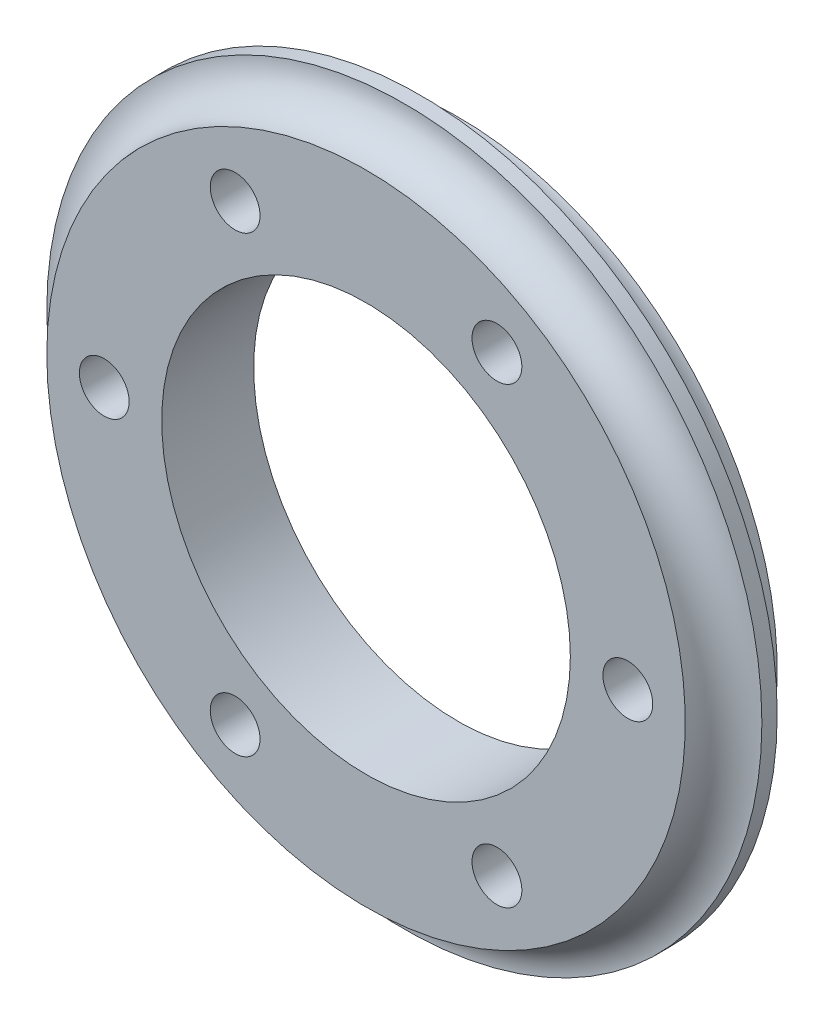
ISO-10303-21;
HEADER;
FILE_DESCRIPTION(('STEP AP214'),'2;1');
FILE_NAME('part.step','',(''),(''),'','','');
FILE_SCHEMA(('AUTOMOTIVE_DESIGN { 1 0 10303 214 1 1 1 1 }'));
ENDSEC;
DATA;
#1=APPLICATION_CONTEXT('core data for automotive mechanical design processes');
#2=APPLICATION_PROTOCOL_DEFINITION('international standard','automotive_design',2000,#1);
#3=PRODUCT_CONTEXT('',#1,'mechanical');
#4=PRODUCT('Part','Part','',(#3));
#5=PRODUCT_RELATED_PRODUCT_CATEGORY('part','',(#4));
#6=PRODUCT_DEFINITION_FORMATION('','',#4);
#7=PRODUCT_DEFINITION_CONTEXT('part definition',#1,'design');
#8=PRODUCT_DEFINITION('design','',#6,#7);
#9=PRODUCT_DEFINITION_SHAPE('','',#8);
#10=(LENGTH_UNIT() NAMED_UNIT(*) SI_UNIT(.MILLI.,.METRE.));
#11=(NAMED_UNIT(*) PLANE_ANGLE_UNIT() SI_UNIT($,.RADIAN.));
#12=(NAMED_UNIT(*) SI_UNIT($,.STERADIAN.) SOLID_ANGLE_UNIT());
#13=UNCERTAINTY_MEASURE_WITH_UNIT(LENGTH_MEASURE(1.E-05),#10,'distance_accuracy_value','');
#14=(GEOMETRIC_REPRESENTATION_CONTEXT(3) GLOBAL_UNCERTAINTY_ASSIGNED_CONTEXT((#13)) GLOBAL_UNIT_ASSIGNED_CONTEXT((#10,
#11,#12)) REPRESENTATION_CONTEXT('',''));
#15=CARTESIAN_POINT('',(0.,0.,0.));
#16=DIRECTION('',(0.,0.,1.));
#17=DIRECTION('',(1.,0.,0.));
#18=AXIS2_PLACEMENT_3D('',#15,#16,#17);
#19=CARTESIAN_POINT('',(0.,0.,6.));
#20=DIRECTION('',(0.,0.,-1.));
#21=DIRECTION('',(-1.,0.,0.));
#22=AXIS2_PLACEMENT_3D('',#19,#20,#21);
#23=CYLINDRICAL_SURFACE('',#22,23.335);
#24=CARTESIAN_POINT('',(0.,0.,2.5));
#25=DIRECTION('',(0.,0.,-1.));
#26=DIRECTION('',(-1.,0.,0.));
#27=AXIS2_PLACEMENT_3D('',#24,#25,#26);
#28=CIRCLE('',#27,23.335);
#29=CARTESIAN_POINT('',(-23.335,0.,2.5));
#30=VERTEX_POINT('',#29);
#31=EDGE_CURVE('E47',#30,#30,#28,.T.);
#32=ORIENTED_EDGE('',*,*,#31,.F.);
#33=EDGE_LOOP('',(#32));
#34=FACE_BOUND('',#33,.T.);
#35=CARTESIAN_POINT('',(0.,0.,3.5));
#36=DIRECTION('',(0.,0.,1.));
#37=DIRECTION('',(1.,0.,0.));
#38=AXIS2_PLACEMENT_3D('',#35,#36,#37);
#39=CIRCLE('',#38,23.335);
#40=CARTESIAN_POINT('',(23.335,0.,3.5));
#41=VERTEX_POINT('',#40);
#42=EDGE_CURVE('E49',#41,#41,#39,.T.);
#43=ORIENTED_EDGE('',*,*,#42,.F.);
#44=EDGE_LOOP('',(#43));
#45=FACE_BOUND('',#44,.T.);
#46=ADVANCED_FACE('F31',(#34,#45),#23,.T.);
#47=CARTESIAN_POINT('',(0.,0.,6.));
#48=DIRECTION('',(0.,0.,1.));
#49=DIRECTION('',(1.,0.,0.));
#50=AXIS2_PLACEMENT_3D('',#47,#48,#49);
#51=PLANE('',#50);
#52=CARTESIAN_POINT('',(-17.085,0.,6.));
#53=DIRECTION('',(0.,0.,-1.));
#54=DIRECTION('',(-1.,0.,0.));
#55=AXIS2_PLACEMENT_3D('',#52,#53,#54);
#56=CIRCLE('',#55,1.625);
#57=CARTESIAN_POINT('',(-18.71,0.,6.));
#58=VERTEX_POINT('',#57);
#59=EDGE_CURVE('E86',#58,#58,#56,.T.);
#60=ORIENTED_EDGE('',*,*,#59,.T.);
#61=EDGE_LOOP('',(#60));
#62=FACE_BOUND('',#61,.T.);
#63=CARTESIAN_POINT('',(-8.5425,-14.7960440236571,6.));
#64=DIRECTION('',(0.,0.,-1.));
#65=DIRECTION('',(-1.,0.,0.));
#66=AXIS2_PLACEMENT_3D('',#63,#64,#65);
#67=CIRCLE('',#66,1.625);
#68=CARTESIAN_POINT('',(-10.1675,-14.7960440236571,6.));
#69=VERTEX_POINT('',#68);
#70=EDGE_CURVE('E80',#69,#69,#67,.T.);
#71=ORIENTED_EDGE('',*,*,#70,.T.);
#72=EDGE_LOOP('',(#71));
#73=FACE_BOUND('',#72,.T.);
#74=CARTESIAN_POINT('',(8.54250000000001,-14.7960440236571,6.));
#75=DIRECTION('',(0.,0.,-1.));
#76=DIRECTION('',(-1.,0.,0.));
#77=AXIS2_PLACEMENT_3D('',#74,#75,#76);
#78=CIRCLE('',#77,1.625);
#79=CARTESIAN_POINT('',(6.9175,-14.7960440236571,6.));
#80=VERTEX_POINT('',#79);
#81=EDGE_CURVE('E74',#80,#80,#78,.T.);
#82=ORIENTED_EDGE('',*,*,#81,.T.);
#83=EDGE_LOOP('',(#82));
#84=FACE_BOUND('',#83,.T.);
#85=CARTESIAN_POINT('',(17.085,0.,6.));
#86=DIRECTION('',(0.,0.,-1.));
#87=DIRECTION('',(-1.,0.,0.));
#88=AXIS2_PLACEMENT_3D('',#85,#86,#87);
#89=CIRCLE('',#88,1.625);
#90=CARTESIAN_POINT('',(15.46,0.,6.));
#91=VERTEX_POINT('',#90);
#92=EDGE_CURVE('E68',#91,#91,#89,.T.);
#93=ORIENTED_EDGE('',*,*,#92,.T.);
#94=EDGE_LOOP('',(#93));
#95=FACE_BOUND('',#94,.T.);
#96=CARTESIAN_POINT('',(8.5425,14.7960440236571,6.));
#97=DIRECTION('',(0.,0.,-1.));
#98=DIRECTION('',(-1.,0.,0.));
#99=AXIS2_PLACEMENT_3D('',#96,#97,#98);
#100=CIRCLE('',#99,1.625);
#101=CARTESIAN_POINT('',(6.9175,14.7960440236571,6.));
#102=VERTEX_POINT('',#101);
#103=EDGE_CURVE('E62',#102,#102,#100,.T.);
#104=ORIENTED_EDGE('',*,*,#103,.T.);
#105=EDGE_LOOP('',(#104));
#106=FACE_BOUND('',#105,.T.);
#107=CARTESIAN_POINT('',(-8.54250000000001,14.7960440236571,6.));
#108=DIRECTION('',(0.,0.,-1.));
#109=DIRECTION('',(-1.,0.,0.));
#110=AXIS2_PLACEMENT_3D('',#107,#108,#109);
#111=CIRCLE('',#110,1.625);
#112=CARTESIAN_POINT('',(-10.1675,14.7960440236571,6.));
#113=VERTEX_POINT('',#112);
#114=EDGE_CURVE('E57',#113,#113,#111,.T.);
#115=ORIENTED_EDGE('',*,*,#114,.T.);
#116=EDGE_LOOP('',(#115));
#117=FACE_BOUND('',#116,.T.);
#118=CARTESIAN_POINT('',(0.,0.,6.));
#119=DIRECTION('',(0.,0.,1.));
#120=DIRECTION('',(1.,0.,0.));
#121=AXIS2_PLACEMENT_3D('',#118,#119,#120);
#122=CIRCLE('',#121,13.335);
#123=CARTESIAN_POINT('',(13.335,0.,6.));
#124=VERTEX_POINT('',#123);
#125=EDGE_CURVE('E10',#124,#124,#122,.T.);
#126=ORIENTED_EDGE('',*,*,#125,.F.);
#127=EDGE_LOOP('',(#126));
#128=FACE_BOUND('',#127,.T.);
#129=CARTESIAN_POINT('',(0.,0.,6.));
#130=DIRECTION('',(0.,0.,-1.));
#131=DIRECTION('',(-1.,0.,0.));
#132=AXIS2_PLACEMENT_3D('',#129,#130,#131);
#133=CIRCLE('',#132,20.835);
#134=CARTESIAN_POINT('',(-20.835,0.,6.));
#135=VERTEX_POINT('',#134);
#136=EDGE_CURVE('E34',#135,#135,#133,.F.);
#137=ORIENTED_EDGE('',*,*,#136,.T.);
#138=EDGE_LOOP('',(#137));
#139=FACE_BOUND('',#138,.T.);
#140=ADVANCED_FACE('F95',(#62,#73,#84,#95,#106,#117,#128,#139),#51,.T.);
#141=CARTESIAN_POINT('',(0.,0.,0.));
#142=DIRECTION('',(0.,0.,1.));
#143=DIRECTION('',(1.,0.,0.));
#144=AXIS2_PLACEMENT_3D('',#141,#142,#143);
#145=PLANE('',#144);
#146=CARTESIAN_POINT('',(-17.085,0.,0.));
#147=DIRECTION('',(0.,0.,-1.));
#148=DIRECTION('',(-1.,0.,0.));
#149=AXIS2_PLACEMENT_3D('',#146,#147,#148);
#150=CIRCLE('',#149,1.625);
#151=CARTESIAN_POINT('',(-18.71,0.,0.));
#152=VERTEX_POINT('',#151);
#153=EDGE_CURVE('E89',#152,#152,#150,.T.);
#154=ORIENTED_EDGE('',*,*,#153,.F.);
#155=EDGE_LOOP('',(#154));
#156=FACE_BOUND('',#155,.T.);
#157=CARTESIAN_POINT('',(-8.5425,-14.7960440236571,0.));
#158=DIRECTION('',(0.,0.,-1.));
#159=DIRECTION('',(-1.,0.,0.));
#160=AXIS2_PLACEMENT_3D('',#157,#158,#159);
#161=CIRCLE('',#160,1.625);
#162=CARTESIAN_POINT('',(-10.1675,-14.7960440236571,0.));
#163=VERTEX_POINT('',#162);
#164=EDGE_CURVE('E83',#163,#163,#161,.T.);
#165=ORIENTED_EDGE('',*,*,#164,.F.);
#166=EDGE_LOOP('',(#165));
#167=FACE_BOUND('',#166,.T.);
#168=CARTESIAN_POINT('',(8.54250000000001,-14.7960440236571,0.));
#169=DIRECTION('',(0.,0.,-1.));
#170=DIRECTION('',(-1.,0.,0.));
#171=AXIS2_PLACEMENT_3D('',#168,#169,#170);
#172=CIRCLE('',#171,1.625);
#173=CARTESIAN_POINT('',(6.9175,-14.7960440236571,0.));
#174=VERTEX_POINT('',#173);
#175=EDGE_CURVE('E77',#174,#174,#172,.T.);
#176=ORIENTED_EDGE('',*,*,#175,.F.);
#177=EDGE_LOOP('',(#176));
#178=FACE_BOUND('',#177,.T.);
#179=CARTESIAN_POINT('',(17.085,0.,0.));
#180=DIRECTION('',(0.,0.,-1.));
#181=DIRECTION('',(-1.,0.,0.));
#182=AXIS2_PLACEMENT_3D('',#179,#180,#181);
#183=CIRCLE('',#182,1.625);
#184=CARTESIAN_POINT('',(15.46,0.,0.));
#185=VERTEX_POINT('',#184);
#186=EDGE_CURVE('E71',#185,#185,#183,.T.);
#187=ORIENTED_EDGE('',*,*,#186,.F.);
#188=EDGE_LOOP('',(#187));
#189=FACE_BOUND('',#188,.T.);
#190=CARTESIAN_POINT('',(8.5425,14.7960440236571,0.));
#191=DIRECTION('',(0.,0.,-1.));
#192=DIRECTION('',(-1.,0.,0.));
#193=AXIS2_PLACEMENT_3D('',#190,#191,#192);
#194=CIRCLE('',#193,1.625);
#195=CARTESIAN_POINT('',(6.9175,14.7960440236571,0.));
#196=VERTEX_POINT('',#195);
#197=EDGE_CURVE('E65',#196,#196,#194,.T.);
#198=ORIENTED_EDGE('',*,*,#197,.F.);
#199=EDGE_LOOP('',(#198));
#200=FACE_BOUND('',#199,.T.);
#201=CARTESIAN_POINT('',(-8.54250000000001,14.7960440236571,0.));
#202=DIRECTION('',(0.,0.,-1.));
#203=DIRECTION('',(-1.,0.,0.));
#204=AXIS2_PLACEMENT_3D('',#201,#202,#203);
#205=CIRCLE('',#204,1.625);
#206=CARTESIAN_POINT('',(-10.1675,14.7960440236571,0.));
#207=VERTEX_POINT('',#206);
#208=EDGE_CURVE('E59',#207,#207,#205,.T.);
#209=ORIENTED_EDGE('',*,*,#208,.F.);
#210=EDGE_LOOP('',(#209));
#211=FACE_BOUND('',#210,.T.);
#212=CARTESIAN_POINT('',(0.,0.,0.));
#213=DIRECTION('',(0.,0.,1.));
#214=DIRECTION('',(1.,0.,0.));
#215=AXIS2_PLACEMENT_3D('',#212,#213,#214);
#216=CIRCLE('',#215,13.335);
#217=CARTESIAN_POINT('',(13.335,0.,0.));
#218=VERTEX_POINT('',#217);
#219=EDGE_CURVE('E38',#218,#218,#216,.T.);
#220=ORIENTED_EDGE('',*,*,#219,.T.);
#221=EDGE_LOOP('',(#220));
#222=FACE_BOUND('',#221,.T.);
#223=CARTESIAN_POINT('',(0.,0.,0.));
#224=DIRECTION('',(0.,0.,-1.));
#225=DIRECTION('',(-1.,0.,0.));
#226=AXIS2_PLACEMENT_3D('',#223,#224,#225);
#227=CIRCLE('',#226,20.835);
#228=CARTESIAN_POINT('',(-20.835,0.,0.));
#229=VERTEX_POINT('',#228);
#230=EDGE_CURVE('E43',#229,#229,#227,.F.);
#231=ORIENTED_EDGE('',*,*,#230,.F.);
#232=EDGE_LOOP('',(#231));
#233=FACE_BOUND('',#232,.T.);
#234=ADVANCED_FACE('F105',(#156,#167,#178,#189,#200,#211,#222,#233),#145,.F.);
#235=CARTESIAN_POINT('',(0.,0.,6.));
#236=DIRECTION('',(0.,0.,-1.));
#237=DIRECTION('',(-1.,0.,0.));
#238=AXIS2_PLACEMENT_3D('',#235,#236,#237);
#239=CYLINDRICAL_SURFACE('',#238,13.335);
#240=ORIENTED_EDGE('',*,*,#125,.T.);
#241=EDGE_LOOP('',(#240));
#242=FACE_BOUND('',#241,.T.);
#243=ORIENTED_EDGE('',*,*,#219,.F.);
#244=EDGE_LOOP('',(#243));
#245=FACE_BOUND('',#244,.T.);
#246=ADVANCED_FACE('F108',(#242,#245),#239,.F.);
#247=CARTESIAN_POINT('',(0.,0.,0.));
#248=DIRECTION('',(0.,0.,1.));
#249=DIRECTION('',(1.,0.,0.));
#250=AXIS2_PLACEMENT_3D('',#247,#248,#249);
#251=TOROIDAL_SURFACE('',#250,23.335,2.5);
#252=ORIENTED_EDGE('',*,*,#31,.T.);
#253=EDGE_LOOP('',(#252));
#254=FACE_BOUND('',#253,.T.);
#255=ORIENTED_EDGE('',*,*,#230,.T.);
#256=EDGE_LOOP('',(#255));
#257=FACE_BOUND('',#256,.T.);
#258=ADVANCED_FACE('F123',(#254,#257),#251,.F.);
#259=CARTESIAN_POINT('',(0.,0.,6.));
#260=DIRECTION('',(0.,0.,1.));
#261=DIRECTION('',(1.,0.,0.));
#262=AXIS2_PLACEMENT_3D('',#259,#260,#261);
#263=TOROIDAL_SURFACE('',#262,23.335,2.5);
#264=ORIENTED_EDGE('',*,*,#136,.F.);
#265=EDGE_LOOP('',(#264));
#266=FACE_BOUND('',#265,.T.);
#267=ORIENTED_EDGE('',*,*,#42,.T.);
#268=EDGE_LOOP('',(#267));
#269=FACE_BOUND('',#268,.T.);
#270=ADVANCED_FACE('F125',(#266,#269),#263,.F.);
#271=CARTESIAN_POINT('',(-8.54250000000001,14.7960440236571,6.));
#272=DIRECTION('',(0.,0.,-1.));
#273=DIRECTION('',(-1.,0.,0.));
#274=AXIS2_PLACEMENT_3D('',#271,#272,#273);
#275=CYLINDRICAL_SURFACE('',#274,1.625);
#276=ORIENTED_EDGE('',*,*,#114,.F.);
#277=EDGE_LOOP('',(#276));
#278=FACE_BOUND('',#277,.T.);
#279=ORIENTED_EDGE('',*,*,#208,.T.);
#280=EDGE_LOOP('',(#279));
#281=FACE_BOUND('',#280,.T.);
#282=ADVANCED_FACE('F131',(#278,#281),#275,.F.);
#283=CARTESIAN_POINT('',(8.5425,14.7960440236571,6.));
#284=DIRECTION('',(0.,0.,-1.));
#285=DIRECTION('',(-1.,0.,0.));
#286=AXIS2_PLACEMENT_3D('',#283,#284,#285);
#287=CYLINDRICAL_SURFACE('',#286,1.625);
#288=ORIENTED_EDGE('',*,*,#103,.F.);
#289=EDGE_LOOP('',(#288));
#290=FACE_BOUND('',#289,.T.);
#291=ORIENTED_EDGE('',*,*,#197,.T.);
#292=EDGE_LOOP('',(#291));
#293=FACE_BOUND('',#292,.T.);
#294=ADVANCED_FACE('F175',(#290,#293),#287,.F.);
#295=CARTESIAN_POINT('',(17.085,0.,6.));
#296=DIRECTION('',(0.,0.,-1.));
#297=DIRECTION('',(-1.,0.,0.));
#298=AXIS2_PLACEMENT_3D('',#295,#296,#297);
#299=CYLINDRICAL_SURFACE('',#298,1.625);
#300=ORIENTED_EDGE('',*,*,#92,.F.);
#301=EDGE_LOOP('',(#300));
#302=FACE_BOUND('',#301,.T.);
#303=ORIENTED_EDGE('',*,*,#186,.T.);
#304=EDGE_LOOP('',(#303));
#305=FACE_BOUND('',#304,.T.);
#306=ADVANCED_FACE('F182',(#302,#305),#299,.F.);
#307=CARTESIAN_POINT('',(8.54250000000001,-14.7960440236571,6.));
#308=DIRECTION('',(0.,0.,-1.));
#309=DIRECTION('',(-1.,0.,0.));
#310=AXIS2_PLACEMENT_3D('',#307,#308,#309);
#311=CYLINDRICAL_SURFACE('',#310,1.625);
#312=ORIENTED_EDGE('',*,*,#81,.F.);
#313=EDGE_LOOP('',(#312));
#314=FACE_BOUND('',#313,.T.);
#315=ORIENTED_EDGE('',*,*,#175,.T.);
#316=EDGE_LOOP('',(#315));
#317=FACE_BOUND('',#316,.T.);
#318=ADVANCED_FACE('F190',(#314,#317),#311,.F.);
#319=CARTESIAN_POINT('',(-8.5425,-14.7960440236571,6.));
#320=DIRECTION('',(0.,0.,-1.));
#321=DIRECTION('',(-1.,0.,0.));
#322=AXIS2_PLACEMENT_3D('',#319,#320,#321);
#323=CYLINDRICAL_SURFACE('',#322,1.625);
#324=ORIENTED_EDGE('',*,*,#70,.F.);
#325=EDGE_LOOP('',(#324));
#326=FACE_BOUND('',#325,.T.);
#327=ORIENTED_EDGE('',*,*,#164,.T.);
#328=EDGE_LOOP('',(#327));
#329=FACE_BOUND('',#328,.T.);
#330=ADVANCED_FACE('F101',(#326,#329),#323,.F.);
#331=CARTESIAN_POINT('',(-17.085,0.,6.));
#332=DIRECTION('',(0.,0.,-1.));
#333=DIRECTION('',(-1.,0.,0.));
#334=AXIS2_PLACEMENT_3D('',#331,#332,#333);
#335=CYLINDRICAL_SURFACE('',#334,1.625);
#336=ORIENTED_EDGE('',*,*,#59,.F.);
#337=EDGE_LOOP('',(#336));
#338=FACE_BOUND('',#337,.T.);
#339=ORIENTED_EDGE('',*,*,#153,.T.);
#340=EDGE_LOOP('',(#339));
#341=FACE_BOUND('',#340,.T.);
#342=ADVANCED_FACE('F98',(#338,#341),#335,.F.);
#343=CLOSED_SHELL('',(#46,#140,#234,#246,#258,#270,#282,#294,#306,#318,#330,#342));
#344=MANIFOLD_SOLID_BREP('B2',#343);
#345=ADVANCED_BREP_SHAPE_REPRESENTATION('',(#18,#344),#14);
#346=SHAPE_DEFINITION_REPRESENTATION(#9,#345);
ENDSEC;
END-ISO-10303-21;
